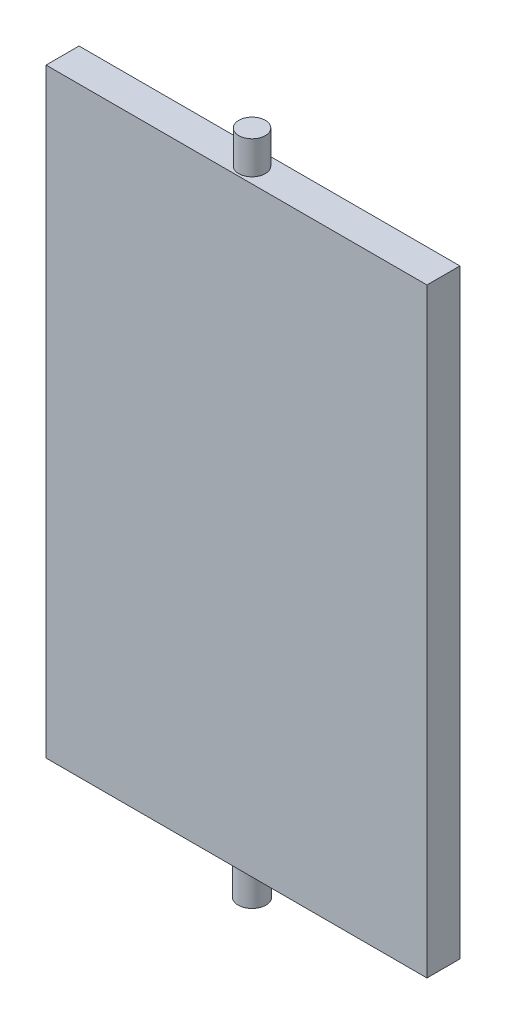
ISO-10303-21;
HEADER;
FILE_DESCRIPTION(('STEP AP214'),'2;1');
FILE_NAME('part.step','',(''),(''),'','','');
FILE_SCHEMA(('AUTOMOTIVE_DESIGN { 1 0 10303 214 1 1 1 1 }'));
ENDSEC;
DATA;
#1=APPLICATION_CONTEXT('core data for automotive mechanical design processes');
#2=APPLICATION_PROTOCOL_DEFINITION('international standard','automotive_design',2000,#1);
#3=PRODUCT_CONTEXT('',#1,'mechanical');
#4=PRODUCT('Part','Part','',(#3));
#5=PRODUCT_RELATED_PRODUCT_CATEGORY('part','',(#4));
#6=PRODUCT_DEFINITION_FORMATION('','',#4);
#7=PRODUCT_DEFINITION_CONTEXT('part definition',#1,'design');
#8=PRODUCT_DEFINITION('design','',#6,#7);
#9=PRODUCT_DEFINITION_SHAPE('','',#8);
#10=(LENGTH_UNIT() NAMED_UNIT(*) SI_UNIT(.MILLI.,.METRE.));
#11=(NAMED_UNIT(*) PLANE_ANGLE_UNIT() SI_UNIT($,.RADIAN.));
#12=(NAMED_UNIT(*) SI_UNIT($,.STERADIAN.) SOLID_ANGLE_UNIT());
#13=UNCERTAINTY_MEASURE_WITH_UNIT(LENGTH_MEASURE(1.E-05),#10,'distance_accuracy_value','');
#14=(GEOMETRIC_REPRESENTATION_CONTEXT(3) GLOBAL_UNCERTAINTY_ASSIGNED_CONTEXT((#13)) GLOBAL_UNIT_ASSIGNED_CONTEXT((#10,
#11,#12)) REPRESENTATION_CONTEXT('',''));
#15=CARTESIAN_POINT('',(0.,0.,0.));
#16=DIRECTION('',(0.,0.,1.));
#17=DIRECTION('',(1.,0.,0.));
#18=AXIS2_PLACEMENT_3D('',#15,#16,#17);
#19=CARTESIAN_POINT('',(0.,0.,20.));
#20=DIRECTION('',(0.,0.,-1.));
#21=DIRECTION('',(-1.,0.,0.));
#22=AXIS2_PLACEMENT_3D('',#19,#20,#21);
#23=PLANE('',#22);
#24=DIRECTION('',(1.,0.,0.));
#25=VECTOR('',#24,1.);
#26=CARTESIAN_POINT('',(-21.7710005151304,8.77391304347826,20.));
#27=LINE('',#26,#25);
#28=CARTESIAN_POINT('',(-21.7710005151304,8.77391304347826,20.));
#29=VERTEX_POINT('',#28);
#30=CARTESIAN_POINT('',(209.22899948487,8.77391304347824,20.));
#31=VERTEX_POINT('',#30);
#32=EDGE_CURVE('E77',#29,#31,#27,.T.);
#33=ORIENTED_EDGE('',*,*,#32,.F.);
#34=DIRECTION('',(0.,1.,0.));
#35=VECTOR('',#34,1.);
#36=CARTESIAN_POINT('',(-21.7710005151304,13.7739130434783,20.));
#37=LINE('',#36,#35);
#38=CARTESIAN_POINT('',(-21.7710005151304,-355.226086956522,20.));
#39=VERTEX_POINT('',#38);
#40=EDGE_CURVE('E87',#39,#29,#37,.T.);
#41=ORIENTED_EDGE('',*,*,#40,.F.);
#42=DIRECTION('',(1.,0.,0.));
#43=VECTOR('',#42,1.);
#44=CARTESIAN_POINT('',(214.22899948487,-355.226086956522,20.));
#45=LINE('',#44,#43);
#46=CARTESIAN_POINT('',(209.22899948487,-355.226086956522,20.));
#47=VERTEX_POINT('',#46);
#48=EDGE_CURVE('E99',#39,#47,#45,.T.);
#49=ORIENTED_EDGE('',*,*,#48,.T.);
#50=DIRECTION('',(0.,-1.,0.));
#51=VECTOR('',#50,1.);
#52=CARTESIAN_POINT('',(209.22899948487,-355.226086956522,20.));
#53=LINE('',#52,#51);
#54=EDGE_CURVE('E89',#31,#47,#53,.T.);
#55=ORIENTED_EDGE('',*,*,#54,.F.);
#56=EDGE_LOOP('',(#33,#41,#49,#55));
#57=FACE_BOUND('',#56,.T.);
#58=ADVANCED_FACE('F42',(#57),#23,.F.);
#59=CARTESIAN_POINT('',(0.,0.,0.));
#60=DIRECTION('',(0.,0.,-1.));
#61=DIRECTION('',(-1.,0.,0.));
#62=AXIS2_PLACEMENT_3D('',#59,#60,#61);
#63=PLANE('',#62);
#64=DIRECTION('',(0.,-1.,0.));
#65=VECTOR('',#64,1.);
#66=CARTESIAN_POINT('',(-21.7710005151304,-355.226086956522,0.));
#67=LINE('',#66,#65);
#68=CARTESIAN_POINT('',(-21.7710005151304,8.77391304347826,0.));
#69=VERTEX_POINT('',#68);
#70=CARTESIAN_POINT('',(-21.7710005151304,-355.226086956522,0.));
#71=VERTEX_POINT('',#70);
#72=EDGE_CURVE('E96',#69,#71,#67,.T.);
#73=ORIENTED_EDGE('',*,*,#72,.F.);
#74=DIRECTION('',(-1.,0.,0.));
#75=VECTOR('',#74,1.);
#76=CARTESIAN_POINT('',(-21.7710005151304,8.77391304347826,0.));
#77=LINE('',#76,#75);
#78=CARTESIAN_POINT('',(209.22899948487,8.77391304347826,0.));
#79=VERTEX_POINT('',#78);
#80=EDGE_CURVE('E11',#79,#69,#77,.T.);
#81=ORIENTED_EDGE('',*,*,#80,.F.);
#82=DIRECTION('',(0.,1.,0.));
#83=VECTOR('',#82,1.);
#84=CARTESIAN_POINT('',(209.22899948487,13.7739130434783,0.));
#85=LINE('',#84,#83);
#86=CARTESIAN_POINT('',(209.22899948487,-355.226086956522,0.));
#87=VERTEX_POINT('',#86);
#88=EDGE_CURVE('E103',#87,#79,#85,.T.);
#89=ORIENTED_EDGE('',*,*,#88,.F.);
#90=DIRECTION('',(1.,0.,0.));
#91=VECTOR('',#90,1.);
#92=CARTESIAN_POINT('',(214.22899948487,-355.226086956522,0.));
#93=LINE('',#92,#91);
#94=EDGE_CURVE('E109',#71,#87,#93,.T.);
#95=ORIENTED_EDGE('',*,*,#94,.F.);
#96=EDGE_LOOP('',(#73,#81,#89,#95));
#97=FACE_BOUND('',#96,.T.);
#98=ADVANCED_FACE('F114',(#97),#63,.T.);
#99=CARTESIAN_POINT('',(-21.7710005151304,0.,0.));
#100=DIRECTION('',(1.,0.,0.));
#101=DIRECTION('',(0.,0.,-1.));
#102=AXIS2_PLACEMENT_3D('',#99,#100,#101);
#103=PLANE('',#102);
#104=DIRECTION('',(0.,0.,1.));
#105=VECTOR('',#104,1.);
#106=CARTESIAN_POINT('',(-21.7710005151304,8.77391304347826,0.));
#107=LINE('',#106,#105);
#108=EDGE_CURVE('E46',#69,#29,#107,.T.);
#109=ORIENTED_EDGE('',*,*,#108,.F.);
#110=ORIENTED_EDGE('',*,*,#72,.T.);
#111=DIRECTION('',(0.,0.,1.));
#112=VECTOR('',#111,1.);
#113=CARTESIAN_POINT('',(-21.7710005151304,-355.226086956522,20.));
#114=LINE('',#113,#112);
#115=EDGE_CURVE('E92',#71,#39,#114,.T.);
#116=ORIENTED_EDGE('',*,*,#115,.T.);
#117=ORIENTED_EDGE('',*,*,#40,.T.);
#118=EDGE_LOOP('',(#109,#110,#116,#117));
#119=FACE_BOUND('',#118,.T.);
#120=ADVANCED_FACE('F90',(#119),#103,.F.);
#121=CARTESIAN_POINT('',(209.22899948487,0.,0.));
#122=DIRECTION('',(-1.,0.,0.));
#123=DIRECTION('',(0.,0.,1.));
#124=AXIS2_PLACEMENT_3D('',#121,#122,#123);
#125=PLANE('',#124);
#126=DIRECTION('',(0.,0.,-1.));
#127=VECTOR('',#126,1.);
#128=CARTESIAN_POINT('',(209.22899948487,8.77391304347826,0.));
#129=LINE('',#128,#127);
#130=EDGE_CURVE('E52',#31,#79,#129,.T.);
#131=ORIENTED_EDGE('',*,*,#130,.F.);
#132=ORIENTED_EDGE('',*,*,#54,.T.);
#133=DIRECTION('',(0.,0.,-1.));
#134=VECTOR('',#133,1.);
#135=CARTESIAN_POINT('',(209.22899948487,-355.226086956522,0.));
#136=LINE('',#135,#134);
#137=EDGE_CURVE('E94',#47,#87,#136,.T.);
#138=ORIENTED_EDGE('',*,*,#137,.T.);
#139=ORIENTED_EDGE('',*,*,#88,.T.);
#140=EDGE_LOOP('',(#131,#132,#138,#139));
#141=FACE_BOUND('',#140,.T.);
#142=ADVANCED_FACE('F117',(#141),#125,.F.);
#143=CARTESIAN_POINT('',(93.7289994848696,-375.226086956522,10.5775609169043));
#144=DIRECTION('',(0.,1.,0.));
#145=DIRECTION('',(0.,0.,1.));
#146=AXIS2_PLACEMENT_3D('',#143,#144,#145);
#147=CYLINDRICAL_SURFACE('',#146,8.42600370602709);
#148=CARTESIAN_POINT('',(93.7289994848696,-355.226086956522,10.5775609169043));
#149=DIRECTION('',(0.,1.,0.));
#150=DIRECTION('',(0.,0.,1.));
#151=AXIS2_PLACEMENT_3D('',#148,#149,#150);
#152=CIRCLE('',#151,8.42600370602709);
#153=CARTESIAN_POINT('',(93.7289994848696,-355.226086956522,19.0035646229314));
#154=VERTEX_POINT('',#153);
#155=EDGE_CURVE('E106',#154,#154,#152,.F.);
#156=ORIENTED_EDGE('',*,*,#155,.T.);
#157=EDGE_LOOP('',(#156));
#158=FACE_BOUND('',#157,.T.);
#159=CARTESIAN_POINT('',(93.7289994848696,-375.226086956522,10.5775609169043));
#160=DIRECTION('',(0.,-1.,0.));
#161=DIRECTION('',(0.,0.,-1.));
#162=AXIS2_PLACEMENT_3D('',#159,#160,#161);
#163=CIRCLE('',#162,8.42600370602709);
#164=CARTESIAN_POINT('',(93.7289994848696,-375.226086956522,2.15155721087723));
#165=VERTEX_POINT('',#164);
#166=EDGE_CURVE('E82',#165,#165,#163,.T.);
#167=ORIENTED_EDGE('',*,*,#166,.F.);
#168=EDGE_LOOP('',(#167));
#169=FACE_BOUND('',#168,.T.);
#170=ADVANCED_FACE('F133',(#158,#169),#147,.T.);
#171=CARTESIAN_POINT('',(214.22899948487,-355.226086956522,20.));
#172=DIRECTION('',(0.,1.,0.));
#173=DIRECTION('',(0.,0.,1.));
#174=AXIS2_PLACEMENT_3D('',#171,#172,#173);
#175=PLANE('',#174);
#176=ORIENTED_EDGE('',*,*,#155,.F.);
#177=EDGE_LOOP('',(#176));
#178=FACE_BOUND('',#177,.T.);
#179=ORIENTED_EDGE('',*,*,#94,.T.);
#180=ORIENTED_EDGE('',*,*,#137,.F.);
#181=ORIENTED_EDGE('',*,*,#48,.F.);
#182=ORIENTED_EDGE('',*,*,#115,.F.);
#183=EDGE_LOOP('',(#179,#180,#181,#182));
#184=FACE_BOUND('',#183,.T.);
#185=ADVANCED_FACE('F120',(#178,#184),#175,.F.);
#186=CARTESIAN_POINT('',(93.7289994848696,-375.226086956522,10.5775609169043));
#187=DIRECTION('',(0.,-1.,0.));
#188=DIRECTION('',(0.,0.,-1.));
#189=AXIS2_PLACEMENT_3D('',#186,#187,#188);
#190=PLANE('',#189);
#191=ORIENTED_EDGE('',*,*,#166,.T.);
#192=EDGE_LOOP('',(#191));
#193=FACE_BOUND('',#192,.T.);
#194=ADVANCED_FACE('F137',(#193),#190,.T.);
#195=CARTESIAN_POINT('',(0.,8.77391304347826,0.));
#196=DIRECTION('',(0.,1.,0.));
#197=DIRECTION('',(0.,0.,1.));
#198=AXIS2_PLACEMENT_3D('',#195,#196,#197);
#199=PLANE('',#198);
#200=CARTESIAN_POINT('',(93.7289994848696,8.77391304347826,10.5775609169043));
#201=DIRECTION('',(0.,1.,0.));
#202=DIRECTION('',(0.,0.,1.));
#203=AXIS2_PLACEMENT_3D('',#200,#201,#202);
#204=CIRCLE('',#203,8.05000000000001);
#205=CARTESIAN_POINT('',(93.7289994848696,8.77391304347826,18.6275609169043));
#206=VERTEX_POINT('',#205);
#207=EDGE_CURVE('E123',#206,#206,#204,.T.);
#208=ORIENTED_EDGE('',*,*,#207,.F.);
#209=EDGE_LOOP('',(#208));
#210=FACE_BOUND('',#209,.T.);
#211=ORIENTED_EDGE('',*,*,#108,.T.);
#212=ORIENTED_EDGE('',*,*,#32,.T.);
#213=ORIENTED_EDGE('',*,*,#130,.T.);
#214=ORIENTED_EDGE('',*,*,#80,.T.);
#215=EDGE_LOOP('',(#211,#212,#213,#214));
#216=FACE_BOUND('',#215,.T.);
#217=ADVANCED_FACE('F44',(#210,#216),#199,.T.);
#218=CARTESIAN_POINT('',(93.7289994848696,28.7739130434783,10.5775609169043));
#219=DIRECTION('',(0.,-1.,0.));
#220=DIRECTION('',(0.,0.,-1.));
#221=AXIS2_PLACEMENT_3D('',#218,#219,#220);
#222=CYLINDRICAL_SURFACE('',#221,8.05000000000001);
#223=CARTESIAN_POINT('',(93.7289994848696,28.7739130434783,10.5775609169043));
#224=DIRECTION('',(0.,1.,0.));
#225=DIRECTION('',(0.,0.,1.));
#226=AXIS2_PLACEMENT_3D('',#223,#224,#225);
#227=CIRCLE('',#226,8.05000000000001);
#228=CARTESIAN_POINT('',(93.7289994848696,28.7739130434783,18.6275609169043));
#229=VERTEX_POINT('',#228);
#230=EDGE_CURVE('E121',#229,#229,#227,.T.);
#231=ORIENTED_EDGE('',*,*,#230,.F.);
#232=EDGE_LOOP('',(#231));
#233=FACE_BOUND('',#232,.T.);
#234=ORIENTED_EDGE('',*,*,#207,.T.);
#235=EDGE_LOOP('',(#234));
#236=FACE_BOUND('',#235,.T.);
#237=ADVANCED_FACE('F184',(#233,#236),#222,.T.);
#238=CARTESIAN_POINT('',(0.,28.7739130434783,0.));
#239=DIRECTION('',(0.,1.,0.));
#240=DIRECTION('',(0.,0.,1.));
#241=AXIS2_PLACEMENT_3D('',#238,#239,#240);
#242=PLANE('',#241);
#243=ORIENTED_EDGE('',*,*,#230,.T.);
#244=EDGE_LOOP('',(#243));
#245=FACE_BOUND('',#244,.T.);
#246=ADVANCED_FACE('F193',(#245),#242,.T.);
#247=CLOSED_SHELL('',(#58,#98,#120,#142,#170,#185,#194,#217,#237,#246));
#248=MANIFOLD_SOLID_BREP('B2',#247);
#249=ADVANCED_BREP_SHAPE_REPRESENTATION('',(#18,#248),#14);
#250=SHAPE_DEFINITION_REPRESENTATION(#9,#249);
ENDSEC;
END-ISO-10303-21;
